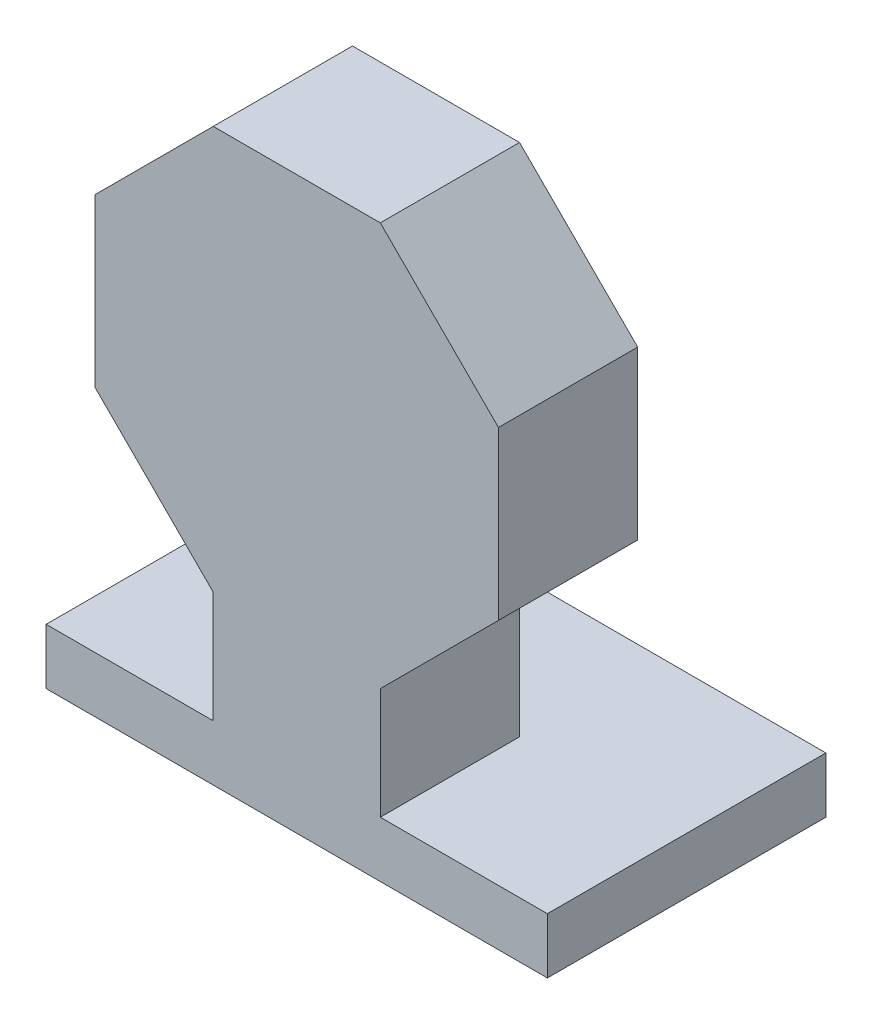
ISO-10303-21;
HEADER;
FILE_DESCRIPTION(('STEP AP214'),'2;1');
FILE_NAME('part.step','',(''),(''),'','','');
FILE_SCHEMA(('AUTOMOTIVE_DESIGN { 1 0 10303 214 1 1 1 1 }'));
ENDSEC;
DATA;
#1=APPLICATION_CONTEXT('core data for automotive mechanical design processes');
#2=APPLICATION_PROTOCOL_DEFINITION('international standard','automotive_design',2000,#1);
#3=PRODUCT_CONTEXT('',#1,'mechanical');
#4=PRODUCT('Part','Part','',(#3));
#5=PRODUCT_RELATED_PRODUCT_CATEGORY('part','',(#4));
#6=PRODUCT_DEFINITION_FORMATION('','',#4);
#7=PRODUCT_DEFINITION_CONTEXT('part definition',#1,'design');
#8=PRODUCT_DEFINITION('design','',#6,#7);
#9=PRODUCT_DEFINITION_SHAPE('','',#8);
#10=(LENGTH_UNIT() NAMED_UNIT(*) SI_UNIT(.MILLI.,.METRE.));
#11=(NAMED_UNIT(*) PLANE_ANGLE_UNIT() SI_UNIT($,.RADIAN.));
#12=(NAMED_UNIT(*) SI_UNIT($,.STERADIAN.) SOLID_ANGLE_UNIT());
#13=UNCERTAINTY_MEASURE_WITH_UNIT(LENGTH_MEASURE(1.E-05),#10,'distance_accuracy_value','');
#14=(GEOMETRIC_REPRESENTATION_CONTEXT(3) GLOBAL_UNCERTAINTY_ASSIGNED_CONTEXT((#13)) GLOBAL_UNIT_ASSIGNED_CONTEXT((#10,
#11,#12)) REPRESENTATION_CONTEXT('',''));
#15=CARTESIAN_POINT('',(0.,0.,0.));
#16=DIRECTION('',(0.,0.,1.));
#17=DIRECTION('',(1.,0.,0.));
#18=AXIS2_PLACEMENT_3D('',#15,#16,#17);
#19=CARTESIAN_POINT('',(36.2132034355964,-15.,25.));
#20=DIRECTION('',(-1.,0.,0.));
#21=DIRECTION('',(0.,0.,1.));
#22=AXIS2_PLACEMENT_3D('',#19,#20,#21);
#23=PLANE('',#22);
#24=DIRECTION('',(0.,1.,0.));
#25=VECTOR('',#24,1.);
#26=CARTESIAN_POINT('',(36.2132034355964,-15.,0.));
#27=LINE('',#26,#25);
#28=CARTESIAN_POINT('',(36.2132034355964,-15.,0.));
#29=VERTEX_POINT('',#28);
#30=CARTESIAN_POINT('',(36.2132034355964,15.,0.));
#31=VERTEX_POINT('',#30);
#32=EDGE_CURVE('E157',#29,#31,#27,.T.);
#33=ORIENTED_EDGE('',*,*,#32,.T.);
#34=DIRECTION('',(0.,0.,-1.));
#35=VECTOR('',#34,1.);
#36=CARTESIAN_POINT('',(36.2132034355964,15.,25.));
#37=LINE('',#36,#35);
#38=CARTESIAN_POINT('',(36.2132034355964,15.,25.));
#39=VERTEX_POINT('',#38);
#40=EDGE_CURVE('E11',#39,#31,#37,.T.);
#41=ORIENTED_EDGE('',*,*,#40,.F.);
#42=DIRECTION('',(0.,1.,0.));
#43=VECTOR('',#42,1.);
#44=CARTESIAN_POINT('',(36.2132034355964,-15.,25.));
#45=LINE('',#44,#43);
#46=CARTESIAN_POINT('',(36.2132034355964,-15.,25.));
#47=VERTEX_POINT('',#46);
#48=EDGE_CURVE('E232',#47,#39,#45,.T.);
#49=ORIENTED_EDGE('',*,*,#48,.F.);
#50=DIRECTION('',(0.,0.,-1.));
#51=VECTOR('',#50,1.);
#52=CARTESIAN_POINT('',(36.2132034355964,-15.,25.));
#53=LINE('',#52,#51);
#54=EDGE_CURVE('E218',#47,#29,#53,.T.);
#55=ORIENTED_EDGE('',*,*,#54,.T.);
#56=EDGE_LOOP('',(#33,#41,#49,#55));
#57=FACE_BOUND('',#56,.T.);
#58=ADVANCED_FACE('F30',(#57),#23,.F.);
#59=CARTESIAN_POINT('',(36.2132034355964,15.,25.));
#60=DIRECTION('',(-0.707106781186548,-0.707106781186548,0.));
#61=DIRECTION('',(0.707106781186548,-0.707106781186548,0.));
#62=AXIS2_PLACEMENT_3D('',#59,#60,#61);
#63=PLANE('',#62);
#64=DIRECTION('',(-0.707106781186548,0.707106781186548,0.));
#65=VECTOR('',#64,1.);
#66=CARTESIAN_POINT('',(36.2132034355964,15.,0.));
#67=LINE('',#66,#65);
#68=CARTESIAN_POINT('',(15.,36.2132034355964,0.));
#69=VERTEX_POINT('',#68);
#70=EDGE_CURVE('E161',#31,#69,#67,.T.);
#71=ORIENTED_EDGE('',*,*,#70,.T.);
#72=DIRECTION('',(0.,0.,-1.));
#73=VECTOR('',#72,1.);
#74=CARTESIAN_POINT('',(15.,36.2132034355964,25.));
#75=LINE('',#74,#73);
#76=CARTESIAN_POINT('',(15.,36.2132034355964,25.));
#77=VERTEX_POINT('',#76);
#78=EDGE_CURVE('E38',#77,#69,#75,.T.);
#79=ORIENTED_EDGE('',*,*,#78,.F.);
#80=DIRECTION('',(-0.707106781186548,0.707106781186548,0.));
#81=VECTOR('',#80,1.);
#82=CARTESIAN_POINT('',(36.2132034355964,15.,25.));
#83=LINE('',#82,#81);
#84=EDGE_CURVE('E229',#39,#77,#83,.T.);
#85=ORIENTED_EDGE('',*,*,#84,.F.);
#86=ORIENTED_EDGE('',*,*,#40,.T.);
#87=EDGE_LOOP('',(#71,#79,#85,#86));
#88=FACE_BOUND('',#87,.T.);
#89=ADVANCED_FACE('F207',(#88),#63,.F.);
#90=CARTESIAN_POINT('',(15.,36.2132034355964,25.));
#91=DIRECTION('',(0.,-1.,0.));
#92=DIRECTION('',(1.,0.,0.));
#93=AXIS2_PLACEMENT_3D('',#90,#91,#92);
#94=PLANE('',#93);
#95=DIRECTION('',(-1.,0.,0.));
#96=VECTOR('',#95,1.);
#97=CARTESIAN_POINT('',(15.,36.2132034355964,0.));
#98=LINE('',#97,#96);
#99=CARTESIAN_POINT('',(-15.,36.2132034355964,0.));
#100=VERTEX_POINT('',#99);
#101=EDGE_CURVE('E225',#69,#100,#98,.T.);
#102=ORIENTED_EDGE('',*,*,#101,.T.);
#103=DIRECTION('',(0.,0.,-1.));
#104=VECTOR('',#103,1.);
#105=CARTESIAN_POINT('',(-15.,36.2132034355964,25.));
#106=LINE('',#105,#104);
#107=CARTESIAN_POINT('',(-15.,36.2132034355964,25.));
#108=VERTEX_POINT('',#107);
#109=EDGE_CURVE('E277',#108,#100,#106,.T.);
#110=ORIENTED_EDGE('',*,*,#109,.F.);
#111=DIRECTION('',(-1.,0.,0.));
#112=VECTOR('',#111,1.);
#113=CARTESIAN_POINT('',(15.,36.2132034355964,25.));
#114=LINE('',#113,#112);
#115=EDGE_CURVE('E231',#77,#108,#114,.T.);
#116=ORIENTED_EDGE('',*,*,#115,.F.);
#117=ORIENTED_EDGE('',*,*,#78,.T.);
#118=EDGE_LOOP('',(#102,#110,#116,#117));
#119=FACE_BOUND('',#118,.T.);
#120=ADVANCED_FACE('F212',(#119),#94,.F.);
#121=CARTESIAN_POINT('',(-15.,36.2132034355964,25.));
#122=DIRECTION('',(0.707106781186548,-0.707106781186548,0.));
#123=DIRECTION('',(0.707106781186548,0.707106781186548,0.));
#124=AXIS2_PLACEMENT_3D('',#121,#122,#123);
#125=PLANE('',#124);
#126=DIRECTION('',(-0.707106781186548,-0.707106781186548,0.));
#127=VECTOR('',#126,1.);
#128=CARTESIAN_POINT('',(-15.,36.2132034355964,0.));
#129=LINE('',#128,#127);
#130=CARTESIAN_POINT('',(-36.2132034355964,15.,0.));
#131=VERTEX_POINT('',#130);
#132=EDGE_CURVE('E288',#100,#131,#129,.T.);
#133=ORIENTED_EDGE('',*,*,#132,.T.);
#134=DIRECTION('',(0.,0.,-1.));
#135=VECTOR('',#134,1.);
#136=CARTESIAN_POINT('',(-36.2132034355964,15.,25.));
#137=LINE('',#136,#135);
#138=CARTESIAN_POINT('',(-36.2132034355964,15.,25.));
#139=VERTEX_POINT('',#138);
#140=EDGE_CURVE('E271',#139,#131,#137,.T.);
#141=ORIENTED_EDGE('',*,*,#140,.F.);
#142=DIRECTION('',(-0.707106781186548,-0.707106781186548,0.));
#143=VECTOR('',#142,1.);
#144=CARTESIAN_POINT('',(-15.,36.2132034355964,25.));
#145=LINE('',#144,#143);
#146=EDGE_CURVE('E240',#108,#139,#145,.T.);
#147=ORIENTED_EDGE('',*,*,#146,.F.);
#148=ORIENTED_EDGE('',*,*,#109,.T.);
#149=EDGE_LOOP('',(#133,#141,#147,#148));
#150=FACE_BOUND('',#149,.T.);
#151=ADVANCED_FACE('F287',(#150),#125,.F.);
#152=CARTESIAN_POINT('',(-36.2132034355964,15.,25.));
#153=DIRECTION('',(1.,0.,0.));
#154=DIRECTION('',(0.,1.,0.));
#155=AXIS2_PLACEMENT_3D('',#152,#153,#154);
#156=PLANE('',#155);
#157=DIRECTION('',(0.,-1.,0.));
#158=VECTOR('',#157,1.);
#159=CARTESIAN_POINT('',(-36.2132034355964,15.,0.));
#160=LINE('',#159,#158);
#161=CARTESIAN_POINT('',(-36.2132034355964,-15.,0.));
#162=VERTEX_POINT('',#161);
#163=EDGE_CURVE('E292',#131,#162,#160,.T.);
#164=ORIENTED_EDGE('',*,*,#163,.T.);
#165=DIRECTION('',(0.,0.,-1.));
#166=VECTOR('',#165,1.);
#167=CARTESIAN_POINT('',(-36.2132034355964,-15.,25.));
#168=LINE('',#167,#166);
#169=CARTESIAN_POINT('',(-36.2132034355964,-15.,25.));
#170=VERTEX_POINT('',#169);
#171=EDGE_CURVE('E265',#170,#162,#168,.T.);
#172=ORIENTED_EDGE('',*,*,#171,.F.);
#173=DIRECTION('',(0.,-1.,0.));
#174=VECTOR('',#173,1.);
#175=CARTESIAN_POINT('',(-36.2132034355964,15.,25.));
#176=LINE('',#175,#174);
#177=EDGE_CURVE('E242',#139,#170,#176,.T.);
#178=ORIENTED_EDGE('',*,*,#177,.F.);
#179=ORIENTED_EDGE('',*,*,#140,.T.);
#180=EDGE_LOOP('',(#164,#172,#178,#179));
#181=FACE_BOUND('',#180,.T.);
#182=ADVANCED_FACE('F291',(#181),#156,.F.);
#183=CARTESIAN_POINT('',(-36.2132034355964,-15.,25.));
#184=DIRECTION('',(0.707106781186547,0.707106781186548,0.));
#185=DIRECTION('',(-0.707106781186548,0.707106781186547,0.));
#186=AXIS2_PLACEMENT_3D('',#183,#184,#185);
#187=PLANE('',#186);
#188=DIRECTION('',(0.707106781186548,-0.707106781186547,0.));
#189=VECTOR('',#188,1.);
#190=CARTESIAN_POINT('',(-36.2132034355964,-15.,0.));
#191=LINE('',#190,#189);
#192=CARTESIAN_POINT('',(-15.,-36.2132034355964,0.));
#193=VERTEX_POINT('',#192);
#194=EDGE_CURVE('E294',#162,#193,#191,.T.);
#195=ORIENTED_EDGE('',*,*,#194,.T.);
#196=DIRECTION('',(0.,0.,-1.));
#197=VECTOR('',#196,1.);
#198=CARTESIAN_POINT('',(-15.,-36.2132034355964,25.));
#199=LINE('',#198,#197);
#200=CARTESIAN_POINT('',(-15.,-36.2132034355964,25.));
#201=VERTEX_POINT('',#200);
#202=EDGE_CURVE('E253',#201,#193,#199,.T.);
#203=ORIENTED_EDGE('',*,*,#202,.F.);
#204=DIRECTION('',(0.707106781186548,-0.707106781186547,0.));
#205=VECTOR('',#204,1.);
#206=CARTESIAN_POINT('',(-36.2132034355964,-15.,25.));
#207=LINE('',#206,#205);
#208=EDGE_CURVE('E244',#170,#201,#207,.T.);
#209=ORIENTED_EDGE('',*,*,#208,.F.);
#210=ORIENTED_EDGE('',*,*,#171,.T.);
#211=EDGE_LOOP('',(#195,#203,#209,#210));
#212=FACE_BOUND('',#211,.T.);
#213=ADVANCED_FACE('F293',(#212),#187,.F.);
#214=CARTESIAN_POINT('',(-15.,-56.2132034355964,25.));
#215=DIRECTION('',(1.,0.,0.));
#216=DIRECTION('',(0.,1.,0.));
#217=AXIS2_PLACEMENT_3D('',#214,#215,#216);
#218=PLANE('',#217);
#219=DIRECTION('',(0.,-1.,0.));
#220=VECTOR('',#219,1.);
#221=CARTESIAN_POINT('',(-15.,-56.2132034355964,0.));
#222=LINE('',#221,#220);
#223=CARTESIAN_POINT('',(-15.,-56.2132034355964,0.));
#224=VERTEX_POINT('',#223);
#225=EDGE_CURVE('E296',#193,#224,#222,.T.);
#226=ORIENTED_EDGE('',*,*,#225,.T.);
#227=DIRECTION('',(0.,0.,-1.));
#228=VECTOR('',#227,1.);
#229=CARTESIAN_POINT('',(-15.,-56.2132034355964,25.));
#230=LINE('',#229,#228);
#231=CARTESIAN_POINT('',(-15.,-56.2132034355964,25.));
#232=VERTEX_POINT('',#231);
#233=EDGE_CURVE('E257',#232,#224,#230,.T.);
#234=ORIENTED_EDGE('',*,*,#233,.F.);
#235=DIRECTION('',(0.,-1.,0.));
#236=VECTOR('',#235,1.);
#237=CARTESIAN_POINT('',(-15.,-56.2132034355964,25.));
#238=LINE('',#237,#236);
#239=EDGE_CURVE('E138',#201,#232,#238,.T.);
#240=ORIENTED_EDGE('',*,*,#239,.F.);
#241=ORIENTED_EDGE('',*,*,#202,.T.);
#242=EDGE_LOOP('',(#226,#234,#240,#241));
#243=FACE_BOUND('',#242,.T.);
#244=ADVANCED_FACE('F295',(#243),#218,.F.);
#245=CARTESIAN_POINT('',(15.,-36.2132034355964,25.));
#246=DIRECTION('',(-1.,0.,0.));
#247=DIRECTION('',(0.,-1.,0.));
#248=AXIS2_PLACEMENT_3D('',#245,#246,#247);
#249=PLANE('',#248);
#250=DIRECTION('',(0.,1.,0.));
#251=VECTOR('',#250,1.);
#252=CARTESIAN_POINT('',(15.,-36.2132034355964,0.));
#253=LINE('',#252,#251);
#254=CARTESIAN_POINT('',(15.,-56.2132034355964,0.));
#255=VERTEX_POINT('',#254);
#256=CARTESIAN_POINT('',(15.,-36.2132034355964,0.));
#257=VERTEX_POINT('',#256);
#258=EDGE_CURVE('E235',#255,#257,#253,.T.);
#259=ORIENTED_EDGE('',*,*,#258,.T.);
#260=DIRECTION('',(0.,0.,-1.));
#261=VECTOR('',#260,1.);
#262=CARTESIAN_POINT('',(15.,-36.2132034355964,25.));
#263=LINE('',#262,#261);
#264=CARTESIAN_POINT('',(15.,-36.2132034355964,25.));
#265=VERTEX_POINT('',#264);
#266=EDGE_CURVE('E248',#265,#257,#263,.T.);
#267=ORIENTED_EDGE('',*,*,#266,.F.);
#268=DIRECTION('',(0.,1.,0.));
#269=VECTOR('',#268,1.);
#270=CARTESIAN_POINT('',(15.,-36.2132034355964,25.));
#271=LINE('',#270,#269);
#272=CARTESIAN_POINT('',(15.,-56.2132034355964,25.));
#273=VERTEX_POINT('',#272);
#274=EDGE_CURVE('E51',#273,#265,#271,.T.);
#275=ORIENTED_EDGE('',*,*,#274,.F.);
#276=DIRECTION('',(0.,0.,-1.));
#277=VECTOR('',#276,1.);
#278=CARTESIAN_POINT('',(15.,-56.2132034355964,25.));
#279=LINE('',#278,#277);
#280=EDGE_CURVE('E193',#273,#255,#279,.T.);
#281=ORIENTED_EDGE('',*,*,#280,.T.);
#282=EDGE_LOOP('',(#259,#267,#275,#281));
#283=FACE_BOUND('',#282,.T.);
#284=ADVANCED_FACE('F303',(#283),#249,.F.);
#285=CARTESIAN_POINT('',(15.,-36.2132034355964,25.));
#286=DIRECTION('',(-0.707106781186548,0.707106781186547,0.));
#287=DIRECTION('',(-0.707106781186547,-0.707106781186548,0.));
#288=AXIS2_PLACEMENT_3D('',#285,#286,#287);
#289=PLANE('',#288);
#290=DIRECTION('',(0.707106781186547,0.707106781186548,0.));
#291=VECTOR('',#290,1.);
#292=CARTESIAN_POINT('',(15.,-36.2132034355964,0.));
#293=LINE('',#292,#291);
#294=EDGE_CURVE('E222',#257,#29,#293,.T.);
#295=ORIENTED_EDGE('',*,*,#294,.T.);
#296=ORIENTED_EDGE('',*,*,#54,.F.);
#297=DIRECTION('',(0.707106781186547,0.707106781186548,0.));
#298=VECTOR('',#297,1.);
#299=CARTESIAN_POINT('',(15.,-36.2132034355964,25.));
#300=LINE('',#299,#298);
#301=EDGE_CURVE('E46',#265,#47,#300,.T.);
#302=ORIENTED_EDGE('',*,*,#301,.F.);
#303=ORIENTED_EDGE('',*,*,#266,.T.);
#304=EDGE_LOOP('',(#295,#296,#302,#303));
#305=FACE_BOUND('',#304,.T.);
#306=ADVANCED_FACE('F305',(#305),#289,.F.);
#307=CARTESIAN_POINT('',(36.2132034355964,36.2132034355964,25.));
#308=DIRECTION('',(0.,0.,1.));
#309=DIRECTION('',(1.,0.,0.));
#310=AXIS2_PLACEMENT_3D('',#307,#308,#309);
#311=PLANE('',#310);
#312=ORIENTED_EDGE('',*,*,#48,.T.);
#313=ORIENTED_EDGE('',*,*,#84,.T.);
#314=ORIENTED_EDGE('',*,*,#115,.T.);
#315=ORIENTED_EDGE('',*,*,#146,.T.);
#316=ORIENTED_EDGE('',*,*,#177,.T.);
#317=ORIENTED_EDGE('',*,*,#208,.T.);
#318=ORIENTED_EDGE('',*,*,#239,.T.);
#319=DIRECTION('',(-1.,0.,0.));
#320=VECTOR('',#319,1.);
#321=CARTESIAN_POINT('',(45.,-56.2132034355964,25.));
#322=LINE('',#321,#320);
#323=CARTESIAN_POINT('',(-45.,-56.2132034355964,25.));
#324=VERTEX_POINT('',#323);
#325=EDGE_CURVE('E131',#232,#324,#322,.T.);
#326=ORIENTED_EDGE('',*,*,#325,.T.);
#327=DIRECTION('',(0.,1.,0.));
#328=VECTOR('',#327,1.);
#329=CARTESIAN_POINT('',(-45.,-66.2132034355964,25.));
#330=LINE('',#329,#328);
#331=CARTESIAN_POINT('',(-45.,-66.2132034355964,25.));
#332=VERTEX_POINT('',#331);
#333=EDGE_CURVE('E136',#332,#324,#330,.T.);
#334=ORIENTED_EDGE('',*,*,#333,.F.);
#335=DIRECTION('',(-1.,0.,0.));
#336=VECTOR('',#335,1.);
#337=CARTESIAN_POINT('',(45.,-66.2132034355964,25.));
#338=LINE('',#337,#336);
#339=CARTESIAN_POINT('',(45.,-66.2132034355964,25.));
#340=VERTEX_POINT('',#339);
#341=EDGE_CURVE('E174',#340,#332,#338,.T.);
#342=ORIENTED_EDGE('',*,*,#341,.F.);
#343=DIRECTION('',(0.,1.,0.));
#344=VECTOR('',#343,1.);
#345=CARTESIAN_POINT('',(45.,-66.2132034355964,25.));
#346=LINE('',#345,#344);
#347=CARTESIAN_POINT('',(45.,-56.2132034355964,25.));
#348=VERTEX_POINT('',#347);
#349=EDGE_CURVE('E181',#340,#348,#346,.T.);
#350=ORIENTED_EDGE('',*,*,#349,.T.);
#351=EDGE_CURVE('E142',#348,#273,#322,.T.);
#352=ORIENTED_EDGE('',*,*,#351,.T.);
#353=ORIENTED_EDGE('',*,*,#274,.T.);
#354=ORIENTED_EDGE('',*,*,#301,.T.);
#355=EDGE_LOOP('',(#312,#313,#314,#315,#316,#317,#318,#326,#334,#342,#350,#352,#353,#354));
#356=FACE_BOUND('',#355,.T.);
#357=ADVANCED_FACE('F133',(#356),#311,.T.);
#358=CARTESIAN_POINT('',(36.2132034355964,36.2132034355964,0.));
#359=DIRECTION('',(0.,0.,1.));
#360=DIRECTION('',(1.,0.,0.));
#361=AXIS2_PLACEMENT_3D('',#358,#359,#360);
#362=PLANE('',#361);
#363=ORIENTED_EDGE('',*,*,#32,.F.);
#364=ORIENTED_EDGE('',*,*,#294,.F.);
#365=ORIENTED_EDGE('',*,*,#258,.F.);
#366=DIRECTION('',(1.,0.,0.));
#367=VECTOR('',#366,1.);
#368=CARTESIAN_POINT('',(15.,-56.2132034355964,0.));
#369=LINE('',#368,#367);
#370=EDGE_CURVE('E297',#224,#255,#369,.T.);
#371=ORIENTED_EDGE('',*,*,#370,.F.);
#372=ORIENTED_EDGE('',*,*,#225,.F.);
#373=ORIENTED_EDGE('',*,*,#194,.F.);
#374=ORIENTED_EDGE('',*,*,#163,.F.);
#375=ORIENTED_EDGE('',*,*,#132,.F.);
#376=ORIENTED_EDGE('',*,*,#101,.F.);
#377=ORIENTED_EDGE('',*,*,#70,.F.);
#378=EDGE_LOOP('',(#363,#364,#365,#371,#372,#373,#374,#375,#376,#377));
#379=FACE_BOUND('',#378,.T.);
#380=ADVANCED_FACE('F204',(#379),#362,.F.);
#381=CARTESIAN_POINT('',(-45.,-66.2132034355964,25.));
#382=DIRECTION('',(1.,0.,0.));
#383=DIRECTION('',(0.,1.,0.));
#384=AXIS2_PLACEMENT_3D('',#381,#382,#383);
#385=PLANE('',#384);
#386=DIRECTION('',(0.,0.,-1.));
#387=VECTOR('',#386,1.);
#388=CARTESIAN_POINT('',(-45.,-56.2132034355964,25.));
#389=LINE('',#388,#387);
#390=CARTESIAN_POINT('',(-45.,-56.2132034355964,-25.));
#391=VERTEX_POINT('',#390);
#392=EDGE_CURVE('E145',#324,#391,#389,.T.);
#393=ORIENTED_EDGE('',*,*,#392,.T.);
#394=DIRECTION('',(0.,1.,0.));
#395=VECTOR('',#394,1.);
#396=CARTESIAN_POINT('',(-45.,-66.2132034355964,-25.));
#397=LINE('',#396,#395);
#398=CARTESIAN_POINT('',(-45.,-66.2132034355964,-25.));
#399=VERTEX_POINT('',#398);
#400=EDGE_CURVE('E158',#399,#391,#397,.T.);
#401=ORIENTED_EDGE('',*,*,#400,.F.);
#402=DIRECTION('',(0.,0.,-1.));
#403=VECTOR('',#402,1.);
#404=CARTESIAN_POINT('',(-45.,-66.2132034355964,25.));
#405=LINE('',#404,#403);
#406=EDGE_CURVE('E155',#332,#399,#405,.T.);
#407=ORIENTED_EDGE('',*,*,#406,.F.);
#408=ORIENTED_EDGE('',*,*,#333,.T.);
#409=EDGE_LOOP('',(#393,#401,#407,#408));
#410=FACE_BOUND('',#409,.T.);
#411=ADVANCED_FACE('F154',(#410),#385,.F.);
#412=CARTESIAN_POINT('',(-45.,-66.2132034355964,-25.));
#413=DIRECTION('',(0.,0.,1.));
#414=DIRECTION('',(1.,0.,0.));
#415=AXIS2_PLACEMENT_3D('',#412,#413,#414);
#416=PLANE('',#415);
#417=DIRECTION('',(1.,0.,0.));
#418=VECTOR('',#417,1.);
#419=CARTESIAN_POINT('',(-45.,-56.2132034355964,-25.));
#420=LINE('',#419,#418);
#421=CARTESIAN_POINT('',(45.,-56.2132034355964,-25.));
#422=VERTEX_POINT('',#421);
#423=EDGE_CURVE('E149',#391,#422,#420,.T.);
#424=ORIENTED_EDGE('',*,*,#423,.T.);
#425=DIRECTION('',(0.,1.,0.));
#426=VECTOR('',#425,1.);
#427=CARTESIAN_POINT('',(45.,-66.2132034355964,-25.));
#428=LINE('',#427,#426);
#429=CARTESIAN_POINT('',(45.,-66.2132034355964,-25.));
#430=VERTEX_POINT('',#429);
#431=EDGE_CURVE('E163',#430,#422,#428,.T.);
#432=ORIENTED_EDGE('',*,*,#431,.F.);
#433=DIRECTION('',(1.,0.,0.));
#434=VECTOR('',#433,1.);
#435=CARTESIAN_POINT('',(-45.,-66.2132034355964,-25.));
#436=LINE('',#435,#434);
#437=EDGE_CURVE('E177',#399,#430,#436,.T.);
#438=ORIENTED_EDGE('',*,*,#437,.F.);
#439=ORIENTED_EDGE('',*,*,#400,.T.);
#440=EDGE_LOOP('',(#424,#432,#438,#439));
#441=FACE_BOUND('',#440,.T.);
#442=ADVANCED_FACE('F196',(#441),#416,.F.);
#443=CARTESIAN_POINT('',(45.,-66.2132034355964,25.));
#444=DIRECTION('',(-1.,0.,0.));
#445=DIRECTION('',(0.,-1.,0.));
#446=AXIS2_PLACEMENT_3D('',#443,#444,#445);
#447=PLANE('',#446);
#448=DIRECTION('',(0.,0.,1.));
#449=VECTOR('',#448,1.);
#450=CARTESIAN_POINT('',(45.,-56.2132034355964,25.));
#451=LINE('',#450,#449);
#452=EDGE_CURVE('E172',#422,#348,#451,.T.);
#453=ORIENTED_EDGE('',*,*,#452,.T.);
#454=ORIENTED_EDGE('',*,*,#349,.F.);
#455=DIRECTION('',(0.,0.,1.));
#456=VECTOR('',#455,1.);
#457=CARTESIAN_POINT('',(45.,-66.2132034355964,25.));
#458=LINE('',#457,#456);
#459=EDGE_CURVE('E179',#430,#340,#458,.T.);
#460=ORIENTED_EDGE('',*,*,#459,.F.);
#461=ORIENTED_EDGE('',*,*,#431,.T.);
#462=EDGE_LOOP('',(#453,#454,#460,#461));
#463=FACE_BOUND('',#462,.T.);
#464=ADVANCED_FACE('F187',(#463),#447,.F.);
#465=CARTESIAN_POINT('',(-45.,-66.2132034355964,25.));
#466=DIRECTION('',(0.,-1.,0.));
#467=DIRECTION('',(1.,0.,0.));
#468=AXIS2_PLACEMENT_3D('',#465,#466,#467);
#469=PLANE('',#468);
#470=ORIENTED_EDGE('',*,*,#341,.T.);
#471=ORIENTED_EDGE('',*,*,#406,.T.);
#472=ORIENTED_EDGE('',*,*,#437,.T.);
#473=ORIENTED_EDGE('',*,*,#459,.T.);
#474=EDGE_LOOP('',(#470,#471,#472,#473));
#475=FACE_BOUND('',#474,.T.);
#476=ADVANCED_FACE('F195',(#475),#469,.T.);
#477=CARTESIAN_POINT('',(-45.,-56.2132034355964,25.));
#478=DIRECTION('',(0.,-1.,0.));
#479=DIRECTION('',(1.,0.,0.));
#480=AXIS2_PLACEMENT_3D('',#477,#478,#479);
#481=PLANE('',#480);
#482=ORIENTED_EDGE('',*,*,#280,.F.);
#483=ORIENTED_EDGE('',*,*,#351,.F.);
#484=ORIENTED_EDGE('',*,*,#452,.F.);
#485=ORIENTED_EDGE('',*,*,#423,.F.);
#486=ORIENTED_EDGE('',*,*,#392,.F.);
#487=ORIENTED_EDGE('',*,*,#325,.F.);
#488=ORIENTED_EDGE('',*,*,#233,.T.);
#489=ORIENTED_EDGE('',*,*,#370,.T.);
#490=EDGE_LOOP('',(#482,#483,#484,#485,#486,#487,#488,#489));
#491=FACE_BOUND('',#490,.T.);
#492=ADVANCED_FACE('F147',(#491),#481,.F.);
#493=CLOSED_SHELL('',(#58,#89,#120,#151,#182,#213,#244,#284,#306,#357,#380,#411,#442,#464,#476,#492));
#494=MANIFOLD_SOLID_BREP('B2',#493);
#495=ADVANCED_BREP_SHAPE_REPRESENTATION('',(#18,#494),#14);
#496=SHAPE_DEFINITION_REPRESENTATION(#9,#495);
ENDSEC;
END-ISO-10303-21;
